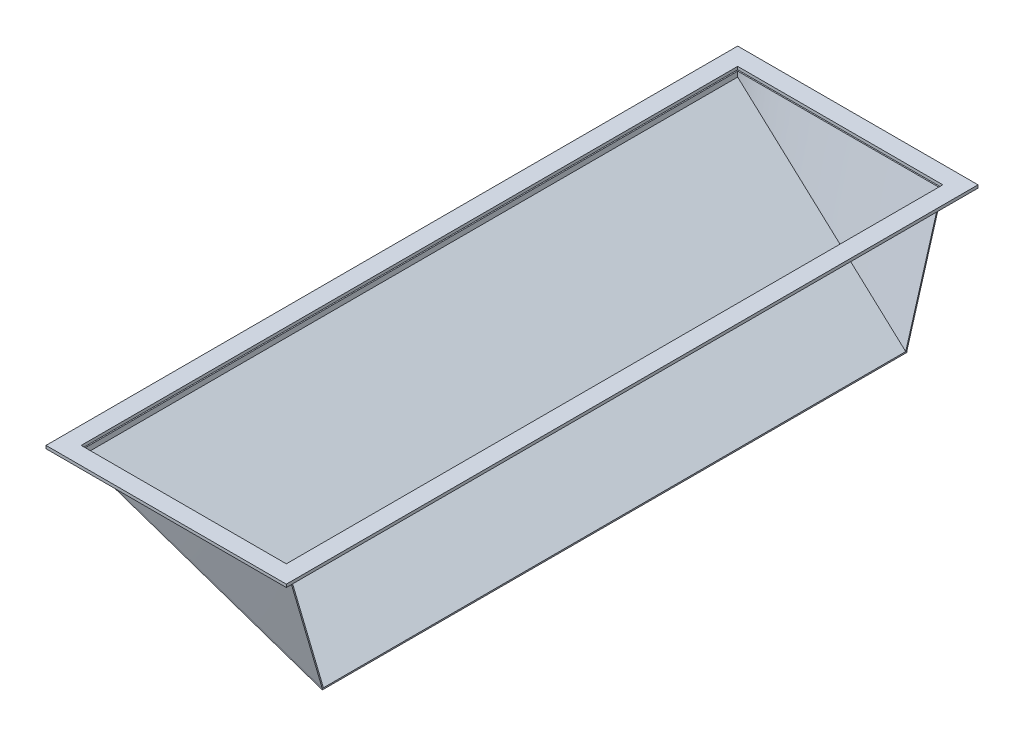
ISO-10303-21;
HEADER;
FILE_DESCRIPTION(('STEP AP214'),'2;1');
FILE_NAME('part.step','',(''),(''),'','','');
FILE_SCHEMA(('AUTOMOTIVE_DESIGN { 1 0 10303 214 1 1 1 1 }'));
ENDSEC;
DATA;
#1=APPLICATION_CONTEXT('core data for automotive mechanical design processes');
#2=APPLICATION_PROTOCOL_DEFINITION('international standard','automotive_design',2000,#1);
#3=PRODUCT_CONTEXT('',#1,'mechanical');
#4=PRODUCT('Part','Part','',(#3));
#5=PRODUCT_RELATED_PRODUCT_CATEGORY('part','',(#4));
#6=PRODUCT_DEFINITION_FORMATION('','',#4);
#7=PRODUCT_DEFINITION_CONTEXT('part definition',#1,'design');
#8=PRODUCT_DEFINITION('design','',#6,#7);
#9=PRODUCT_DEFINITION_SHAPE('','',#8);
#10=(LENGTH_UNIT() NAMED_UNIT(*) SI_UNIT(.MILLI.,.METRE.));
#11=(NAMED_UNIT(*) PLANE_ANGLE_UNIT() SI_UNIT($,.RADIAN.));
#12=(NAMED_UNIT(*) SI_UNIT($,.STERADIAN.) SOLID_ANGLE_UNIT());
#13=UNCERTAINTY_MEASURE_WITH_UNIT(LENGTH_MEASURE(1.E-05),#10,'distance_accuracy_value','');
#14=(GEOMETRIC_REPRESENTATION_CONTEXT(3) GLOBAL_UNCERTAINTY_ASSIGNED_CONTEXT((#13)) GLOBAL_UNIT_ASSIGNED_CONTEXT((#10,
#11,#12)) REPRESENTATION_CONTEXT('',''));
#15=CARTESIAN_POINT('',(0.,0.,0.));
#16=DIRECTION('',(0.,0.,1.));
#17=DIRECTION('',(1.,0.,0.));
#18=AXIS2_PLACEMENT_3D('',#15,#16,#17);
#19=CARTESIAN_POINT('',(0.,0.,1120.));
#20=DIRECTION('',(0.,1.,0.));
#21=DIRECTION('',(0.,0.,-1.));
#22=AXIS2_PLACEMENT_3D('',#19,#20,#21);
#23=PLANE('',#22);
#24=DIRECTION('',(0.,0.,1.));
#25=VECTOR('',#24,1.);
#26=CARTESIAN_POINT('',(2.00000000000004,0.,2.));
#27=LINE('',#26,#25);
#28=CARTESIAN_POINT('',(2.00000000000003,0.,0.));
#29=VERTEX_POINT('',#28);
#30=CARTESIAN_POINT('',(2.00000000000004,0.,2.));
#31=VERTEX_POINT('',#30);
#32=EDGE_CURVE('E103',#29,#31,#27,.T.);
#33=ORIENTED_EDGE('',*,*,#32,.T.);
#34=DIRECTION('',(1.,0.,0.));
#35=VECTOR('',#34,1.);
#36=CARTESIAN_POINT('',(350.,0.,2.));
#37=LINE('',#36,#35);
#38=CARTESIAN_POINT('',(350.,0.,2.));
#39=VERTEX_POINT('',#38);
#40=EDGE_CURVE('E109',#31,#39,#37,.T.);
#41=ORIENTED_EDGE('',*,*,#40,.T.);
#42=DIRECTION('',(0.,0.,-1.));
#43=VECTOR('',#42,1.);
#44=CARTESIAN_POINT('',(350.,0.,0.));
#45=LINE('',#44,#43);
#46=CARTESIAN_POINT('',(350.,0.,0.));
#47=VERTEX_POINT('',#46);
#48=EDGE_CURVE('E117',#39,#47,#45,.T.);
#49=ORIENTED_EDGE('',*,*,#48,.T.);
#50=DIRECTION('',(-1.,0.,0.));
#51=VECTOR('',#50,1.);
#52=CARTESIAN_POINT('',(2.00000000000003,0.,0.));
#53=LINE('',#52,#51);
#54=EDGE_CURVE('E122',#47,#29,#53,.T.);
#55=ORIENTED_EDGE('',*,*,#54,.T.);
#56=EDGE_LOOP('',(#33,#41,#49,#55));
#57=FACE_BOUND('',#56,.T.);
#58=ADVANCED_FACE('F54',(#57),#23,.T.);
#59=CARTESIAN_POINT('',(-3.33012701892212,-5.76794919243114,1120.));
#60=DIRECTION('',(-0.499999999999998,-0.86602540378444,0.));
#61=DIRECTION('',(0.86602540378444,-0.499999999999998,0.));
#62=AXIS2_PLACEMENT_3D('',#59,#60,#61);
#63=PLANE('',#62);
#64=DIRECTION('',(0.,0.,-1.));
#65=VECTOR('',#64,1.);
#66=CARTESIAN_POINT('',(1.99999999999995,-8.84529946162075,0.));
#67=LINE('',#66,#65);
#68=CARTESIAN_POINT('',(1.99999999999995,-8.84529946162075,2.));
#69=VERTEX_POINT('',#68);
#70=CARTESIAN_POINT('',(1.99999999999995,-8.84529946162075,0.));
#71=VERTEX_POINT('',#70);
#72=EDGE_CURVE('E106',#69,#71,#67,.T.);
#73=ORIENTED_EDGE('',*,*,#72,.T.);
#74=DIRECTION('',(0.856128098439509,-0.49428578809485,0.150752242934568));
#75=VECTOR('',#74,1.);
#76=CARTESIAN_POINT('',(1.99999999999995,-8.84529946162075,0.));
#77=LINE('',#76,#75);
#78=CARTESIAN_POINT('',(350.,-209.763193139609,61.2779566946273));
#79=VERTEX_POINT('',#78);
#80=EDGE_CURVE('E13',#71,#79,#77,.T.);
#81=ORIENTED_EDGE('',*,*,#80,.T.);
#82=DIRECTION('',(0.,0.,1.));
#83=VECTOR('',#82,1.);
#84=CARTESIAN_POINT('',(350.,-209.763193139609,61.2779566946273));
#85=LINE('',#84,#83);
#86=CARTESIAN_POINT('',(350.,-209.763193139609,63.3010951441988));
#87=VERTEX_POINT('',#86);
#88=EDGE_CURVE('E65',#79,#87,#85,.T.);
#89=ORIENTED_EDGE('',*,*,#88,.T.);
#90=DIRECTION('',(-0.85612075037956,0.49428154569046,-0.150807872338909));
#91=VECTOR('',#90,1.);
#92=CARTESIAN_POINT('',(1.99999999999995,-8.84529946162075,2.));
#93=LINE('',#92,#91);
#94=EDGE_CURVE('E197',#87,#69,#93,.T.);
#95=ORIENTED_EDGE('',*,*,#94,.T.);
#96=EDGE_LOOP('',(#73,#81,#89,#95));
#97=FACE_BOUND('',#96,.T.);
#98=ADVANCED_FACE('F262',(#97),#63,.T.);
#99=CARTESIAN_POINT('',(1.99999999999995,-8.84529946162075,0.));
#100=CARTESIAN_POINT('',(2.00000000000003,0.,0.));
#101=CARTESIAN_POINT('',(59.9999999999999,-42.3316150746188,10.2129927824379));
#102=CARTESIAN_POINT('',(60.,0.,0.));
#103=CARTESIAN_POINT('',(118.,-75.8179306876169,20.4259855648758));
#104=CARTESIAN_POINT('',(118.,0.,0.));
#105=CARTESIAN_POINT('',(234.,-142.790561913613,40.8519711297517));
#106=CARTESIAN_POINT('',(234.,0.,0.));
#107=CARTESIAN_POINT('',(292.,-176.276877526611,51.0649639121894));
#108=CARTESIAN_POINT('',(292.,0.,0.));
#109=CARTESIAN_POINT('',(350.,-209.763193139609,61.2779566946273));
#110=CARTESIAN_POINT('',(350.,0.,0.));
#111=B_SPLINE_SURFACE_WITH_KNOTS('',3,1,((#99,#100),(#101,#102),(#103,#104),(#105,#106),(#107,
#108),(#109,#110)),.UNSPECIFIED.,.F.,.F.,.F.,(4,2,4),(2,2),(0.,0.5,1.),(0.,1.),.UNSPECIFIED.);
#112=DIRECTION('',(0.,-1.,0.));
#113=VECTOR('',#112,1.);
#114=CARTESIAN_POINT('',(1.99999999999999,-4.42264973081038,0.));
#115=LINE('',#114,#113);
#116=EDGE_CURVE('E193',#29,#71,#115,.T.);
#117=DIRECTION('',(0.,0.95988056828562,-0.280409155748658));
#118=VECTOR('',#117,1.);
#119=CARTESIAN_POINT('',(350.,-104.881596569805,30.6389783473136));
#120=LINE('',#119,#118);
#121=EDGE_CURVE('E74',#79,#47,#120,.T.);
#122=ORIENTED_EDGE('',*,*,#80,.F.);
#123=ORIENTED_EDGE('',*,*,#116,.F.);
#124=ORIENTED_EDGE('',*,*,#54,.F.);
#125=ORIENTED_EDGE('',*,*,#121,.F.);
#126=EDGE_LOOP('',(#122,#123,#124,#125));
#127=FACE_BOUND('',#126,.T.);
#128=ADVANCED_FACE('F174',(#127),#111,.F.);
#129=CARTESIAN_POINT('',(350.,1.85246063812627E-13,1120.));
#130=DIRECTION('',(1.,0.,0.));
#131=DIRECTION('',(0.,1.,0.));
#132=AXIS2_PLACEMENT_3D('',#129,#130,#131);
#133=PLANE('',#132);
#134=DIRECTION('',(0.,0.959852065047477,-0.28050670798413));
#135=VECTOR('',#134,1.);
#136=CARTESIAN_POINT('',(350.,-209.763193139609,63.3010951441988));
#137=LINE('',#136,#135);
#138=EDGE_CURVE('E94',#87,#39,#137,.T.);
#139=ORIENTED_EDGE('',*,*,#138,.F.);
#140=ORIENTED_EDGE('',*,*,#88,.F.);
#141=ORIENTED_EDGE('',*,*,#121,.T.);
#142=ORIENTED_EDGE('',*,*,#48,.F.);
#143=EDGE_LOOP('',(#139,#140,#141,#142));
#144=FACE_BOUND('',#143,.T.);
#145=ADVANCED_FACE('F153',(#144),#133,.T.);
#146=CARTESIAN_POINT('',(2.00000000000429,0.,1120.));
#147=DIRECTION('',(-1.,0.,0.));
#148=DIRECTION('',(0.,-1.,0.));
#149=AXIS2_PLACEMENT_3D('',#146,#147,#148);
#150=PLANE('',#149);
#151=ORIENTED_EDGE('',*,*,#116,.T.);
#152=ORIENTED_EDGE('',*,*,#72,.F.);
#153=DIRECTION('',(0.,1.,0.));
#154=VECTOR('',#153,1.);
#155=CARTESIAN_POINT('',(2.,-4.42264973081038,2.));
#156=LINE('',#155,#154);
#157=EDGE_CURVE('E100',#69,#31,#156,.T.);
#158=ORIENTED_EDGE('',*,*,#157,.T.);
#159=ORIENTED_EDGE('',*,*,#32,.F.);
#160=EDGE_LOOP('',(#151,#152,#158,#159));
#161=FACE_BOUND('',#160,.T.);
#162=ADVANCED_FACE('F101',(#161),#150,.T.);
#163=CARTESIAN_POINT('',(350.,-209.763193139609,63.3010951441988));
#164=CARTESIAN_POINT('',(350.,0.,2.));
#165=CARTESIAN_POINT('',(292.,-176.276877526611,53.084245953499));
#166=CARTESIAN_POINT('',(292.,0.,2.));
#167=CARTESIAN_POINT('',(234.,-142.790561913613,42.8673967627993));
#168=CARTESIAN_POINT('',(234.,0.,2.));
#169=CARTESIAN_POINT('',(118.,-75.8179306876169,22.4336983813997));
#170=CARTESIAN_POINT('',(118.,0.,2.));
#171=CARTESIAN_POINT('',(59.9999999999999,-42.3316150746188,12.2168491906998));
#172=CARTESIAN_POINT('',(59.9999999999999,0.,2.));
#173=CARTESIAN_POINT('',(1.99999999999995,-8.84529946162075,2.));
#174=CARTESIAN_POINT('',(2.00000000000005,0.,2.));
#175=B_SPLINE_SURFACE_WITH_KNOTS('',3,1,((#163,#164),(#165,#166),(#167,#168),(#169,#170),(#171,
#172),(#173,#174)),.UNSPECIFIED.,.F.,.F.,.F.,(4,2,4),(2,2),(0.,0.5,1.),(0.,1.),.UNSPECIFIED.);
#176=ORIENTED_EDGE('',*,*,#94,.F.);
#177=ORIENTED_EDGE('',*,*,#138,.T.);
#178=ORIENTED_EDGE('',*,*,#40,.F.);
#179=ORIENTED_EDGE('',*,*,#157,.F.);
#180=EDGE_LOOP('',(#176,#177,#178,#179));
#181=FACE_BOUND('',#180,.T.);
#182=ADVANCED_FACE('F113',(#181),#175,.F.);
#183=CLOSED_SHELL('',(#58,#98,#128,#145,#162,#182));
#184=MANIFOLD_SOLID_BREP('B2',#183);
#185=CARTESIAN_POINT('',(0.,0.,0.));
#186=DIRECTION('',(0.,1.,0.));
#187=DIRECTION('',(0.,0.,1.));
#188=AXIS2_PLACEMENT_3D('',#185,#186,#187);
#189=PLANE('',#188);
#190=DIRECTION('',(0.,0.,-1.));
#191=VECTOR('',#190,1.);
#192=CARTESIAN_POINT('',(2.00000000000011,0.,1118.));
#193=LINE('',#192,#191);
#194=CARTESIAN_POINT('',(2.0000000000001,0.,1120.));
#195=VERTEX_POINT('',#194);
#196=CARTESIAN_POINT('',(2.00000000000011,0.,1118.));
#197=VERTEX_POINT('',#196);
#198=EDGE_CURVE('E431',#195,#197,#193,.T.);
#199=ORIENTED_EDGE('',*,*,#198,.F.);
#200=DIRECTION('',(-1.,0.,0.));
#201=VECTOR('',#200,1.);
#202=CARTESIAN_POINT('',(2.0000000000001,0.,1120.));
#203=LINE('',#202,#201);
#204=CARTESIAN_POINT('',(350.,0.,1120.));
#205=VERTEX_POINT('',#204);
#206=EDGE_CURVE('E450',#205,#195,#203,.T.);
#207=ORIENTED_EDGE('',*,*,#206,.F.);
#208=DIRECTION('',(0.,0.,1.));
#209=VECTOR('',#208,1.);
#210=CARTESIAN_POINT('',(350.,0.,1120.));
#211=LINE('',#210,#209);
#212=CARTESIAN_POINT('',(350.,0.,1118.));
#213=VERTEX_POINT('',#212);
#214=EDGE_CURVE('E432',#213,#205,#211,.T.);
#215=ORIENTED_EDGE('',*,*,#214,.F.);
#216=DIRECTION('',(1.,0.,0.));
#217=VECTOR('',#216,1.);
#218=CARTESIAN_POINT('',(350.,0.,1118.));
#219=LINE('',#218,#217);
#220=EDGE_CURVE('E427',#197,#213,#219,.T.);
#221=ORIENTED_EDGE('',*,*,#220,.F.);
#222=EDGE_LOOP('',(#199,#207,#215,#221));
#223=FACE_BOUND('',#222,.T.);
#224=ADVANCED_FACE('F385',(#223),#189,.T.);
#225=CARTESIAN_POINT('',(-3.33012701892218,-5.76794919243114,0.));
#226=DIRECTION('',(-0.499999999999998,-0.86602540378444,0.));
#227=DIRECTION('',(0.86602540378444,-0.499999999999998,0.));
#228=AXIS2_PLACEMENT_3D('',#225,#226,#227);
#229=PLANE('',#228);
#230=DIRECTION('',(0.,0.,1.));
#231=VECTOR('',#230,1.);
#232=CARTESIAN_POINT('',(2.00000000000001,-8.84529946162075,1120.));
#233=LINE('',#232,#231);
#234=CARTESIAN_POINT('',(2.00000000000001,-8.84529946162075,1118.));
#235=VERTEX_POINT('',#234);
#236=CARTESIAN_POINT('',(2.00000000000001,-8.84529946162075,1120.));
#237=VERTEX_POINT('',#236);
#238=EDGE_CURVE('E467',#235,#237,#233,.T.);
#239=ORIENTED_EDGE('',*,*,#238,.F.);
#240=DIRECTION('',(-0.85612075037956,0.49428154569046,0.150807872338909));
#241=VECTOR('',#240,1.);
#242=CARTESIAN_POINT('',(2.00000000000001,-8.84529946162075,1118.));
#243=LINE('',#242,#241);
#244=CARTESIAN_POINT('',(350.,-209.763193139609,1056.6989048558));
#245=VERTEX_POINT('',#244);
#246=EDGE_CURVE('E456',#245,#235,#243,.T.);
#247=ORIENTED_EDGE('',*,*,#246,.F.);
#248=DIRECTION('',(0.,0.,-1.));
#249=VECTOR('',#248,1.);
#250=CARTESIAN_POINT('',(350.,-209.763193139609,1058.72204330537));
#251=LINE('',#250,#249);
#252=CARTESIAN_POINT('',(350.,-209.763193139609,1058.72204330537));
#253=VERTEX_POINT('',#252);
#254=EDGE_CURVE('E396',#253,#245,#251,.T.);
#255=ORIENTED_EDGE('',*,*,#254,.F.);
#256=DIRECTION('',(0.856128098439509,-0.49428578809485,-0.150752242934569));
#257=VECTOR('',#256,1.);
#258=CARTESIAN_POINT('',(2.00000000000001,-8.84529946162075,1120.));
#259=LINE('',#258,#257);
#260=EDGE_CURVE('E52',#237,#253,#259,.T.);
#261=ORIENTED_EDGE('',*,*,#260,.F.);
#262=EDGE_LOOP('',(#239,#247,#255,#261));
#263=FACE_BOUND('',#262,.T.);
#264=ADVANCED_FACE('F511',(#263),#229,.T.);
#265=CARTESIAN_POINT('',(2.00000000000001,-8.84529946162075,1120.));
#266=CARTESIAN_POINT('',(2.0000000000001,0.,1120.));
#267=CARTESIAN_POINT('',(60.,-42.3316150746188,1109.78700721756));
#268=CARTESIAN_POINT('',(60.,0.,1120.));
#269=CARTESIAN_POINT('',(118.,-75.8179306876169,1099.57401443512));
#270=CARTESIAN_POINT('',(118.,0.,1120.));
#271=CARTESIAN_POINT('',(234.,-142.790561913613,1079.14802887025));
#272=CARTESIAN_POINT('',(234.,0.,1120.));
#273=CARTESIAN_POINT('',(292.,-176.276877526611,1068.93503608781));
#274=CARTESIAN_POINT('',(292.,0.,1120.));
#275=CARTESIAN_POINT('',(350.,-209.763193139609,1058.72204330537));
#276=CARTESIAN_POINT('',(350.,0.,1120.));
#277=B_SPLINE_SURFACE_WITH_KNOTS('',3,1,((#265,#266),(#267,#268),(#269,#270),(#271,#272),(#273,
#274),(#275,#276)),.UNSPECIFIED.,.F.,.F.,.F.,(4,2,4),(2,2),(0.,0.5,1.),(0.,1.),.UNSPECIFIED.);
#278=DIRECTION('',(0.,0.95988056828562,0.280409155748658));
#279=VECTOR('',#278,1.);
#280=CARTESIAN_POINT('',(350.,-104.881596569805,1089.36102165269));
#281=LINE('',#280,#279);
#282=EDGE_CURVE('E405',#253,#205,#281,.T.);
#283=DIRECTION('',(0.,-1.,0.));
#284=VECTOR('',#283,1.);
#285=CARTESIAN_POINT('',(2.00000000000006,-4.42264973081038,1120.));
#286=LINE('',#285,#284);
#287=EDGE_CURVE('E449',#195,#237,#286,.T.);
#288=ORIENTED_EDGE('',*,*,#260,.T.);
#289=ORIENTED_EDGE('',*,*,#282,.T.);
#290=ORIENTED_EDGE('',*,*,#206,.T.);
#291=ORIENTED_EDGE('',*,*,#287,.T.);
#292=EDGE_LOOP('',(#288,#289,#290,#291));
#293=FACE_BOUND('',#292,.T.);
#294=ADVANCED_FACE('F500',(#293),#277,.T.);
#295=CARTESIAN_POINT('',(350.,1.85246063812627E-13,0.));
#296=DIRECTION('',(1.,0.,0.));
#297=DIRECTION('',(0.,1.,0.));
#298=AXIS2_PLACEMENT_3D('',#295,#296,#297);
#299=PLANE('',#298);
#300=DIRECTION('',(0.,0.959852065047477,0.28050670798413));
#301=VECTOR('',#300,1.);
#302=CARTESIAN_POINT('',(350.,-209.763193139609,1056.6989048558));
#303=LINE('',#302,#301);
#304=EDGE_CURVE('E421',#245,#213,#303,.T.);
#305=ORIENTED_EDGE('',*,*,#304,.T.);
#306=ORIENTED_EDGE('',*,*,#214,.T.);
#307=ORIENTED_EDGE('',*,*,#282,.F.);
#308=ORIENTED_EDGE('',*,*,#254,.T.);
#309=EDGE_LOOP('',(#305,#306,#307,#308));
#310=FACE_BOUND('',#309,.T.);
#311=ADVANCED_FACE('F479',(#310),#299,.T.);
#312=CARTESIAN_POINT('',(2.00000000000423,0.,0.));
#313=DIRECTION('',(-1.,0.,0.));
#314=DIRECTION('',(0.,-1.,0.));
#315=AXIS2_PLACEMENT_3D('',#312,#313,#314);
#316=PLANE('',#315);
#317=ORIENTED_EDGE('',*,*,#287,.F.);
#318=ORIENTED_EDGE('',*,*,#198,.T.);
#319=DIRECTION('',(0.,1.,0.));
#320=VECTOR('',#319,1.);
#321=CARTESIAN_POINT('',(2.00000000000006,-4.42264973081038,1118.));
#322=LINE('',#321,#320);
#323=EDGE_CURVE('E437',#235,#197,#322,.T.);
#324=ORIENTED_EDGE('',*,*,#323,.F.);
#325=ORIENTED_EDGE('',*,*,#238,.T.);
#326=EDGE_LOOP('',(#317,#318,#324,#325));
#327=FACE_BOUND('',#326,.T.);
#328=ADVANCED_FACE('F445',(#327),#316,.T.);
#329=CARTESIAN_POINT('',(350.,-209.763193139609,1056.6989048558));
#330=CARTESIAN_POINT('',(350.,0.,1118.));
#331=CARTESIAN_POINT('',(292.,-176.276877526611,1066.9157540465));
#332=CARTESIAN_POINT('',(292.,0.,1118.));
#333=CARTESIAN_POINT('',(234.,-142.790561913613,1077.1326032372));
#334=CARTESIAN_POINT('',(234.,0.,1118.));
#335=CARTESIAN_POINT('',(118.,-75.8179306876169,1097.5663016186));
#336=CARTESIAN_POINT('',(118.,0.,1118.));
#337=CARTESIAN_POINT('',(60.,-42.3316150746188,1107.7831508093));
#338=CARTESIAN_POINT('',(60.,0.,1118.));
#339=CARTESIAN_POINT('',(2.00000000000001,-8.84529946162075,1118.));
#340=CARTESIAN_POINT('',(2.00000000000011,0.,1118.));
#341=B_SPLINE_SURFACE_WITH_KNOTS('',3,1,((#329,#330),(#331,#332),(#333,#334),(#335,#336),(#337,
#338),(#339,#340)),.UNSPECIFIED.,.F.,.F.,.F.,(4,2,4),(2,2),(0.,0.5,1.),(0.,1.),.UNSPECIFIED.);
#342=ORIENTED_EDGE('',*,*,#246,.T.);
#343=ORIENTED_EDGE('',*,*,#323,.T.);
#344=ORIENTED_EDGE('',*,*,#220,.T.);
#345=ORIENTED_EDGE('',*,*,#304,.F.);
#346=EDGE_LOOP('',(#342,#343,#344,#345));
#347=FACE_BOUND('',#346,.T.);
#348=ADVANCED_FACE('F454',(#347),#341,.T.);
#349=CLOSED_SHELL('',(#224,#264,#294,#311,#328,#348));
#350=MANIFOLD_SOLID_BREP('B7',#349);
#351=CARTESIAN_POINT('',(0.,5.,0.));
#352=DIRECTION('',(0.,-1.,0.));
#353=DIRECTION('',(0.,0.,-1.));
#354=AXIS2_PLACEMENT_3D('',#351,#352,#353);
#355=PLANE('',#354);
#356=DIRECTION('',(0.,0.,1.));
#357=VECTOR('',#356,1.);
#358=CARTESIAN_POINT('',(-29.9999999999997,5.,1150.));
#359=LINE('',#358,#357);
#360=CARTESIAN_POINT('',(-29.9999999999998,5.,-30.));
#361=VERTEX_POINT('',#360);
#362=CARTESIAN_POINT('',(-29.9999999999997,5.,1150.));
#363=VERTEX_POINT('',#362);
#364=EDGE_CURVE('E816',#361,#363,#359,.T.);
#365=ORIENTED_EDGE('',*,*,#364,.T.);
#366=DIRECTION('',(1.,0.,0.));
#367=VECTOR('',#366,1.);
#368=CARTESIAN_POINT('',(380.,5.,1150.));
#369=LINE('',#368,#367);
#370=CARTESIAN_POINT('',(380.,5.,1150.));
#371=VERTEX_POINT('',#370);
#372=EDGE_CURVE('E819',#363,#371,#369,.T.);
#373=ORIENTED_EDGE('',*,*,#372,.T.);
#374=DIRECTION('',(0.,0.,-1.));
#375=VECTOR('',#374,1.);
#376=CARTESIAN_POINT('',(380.,5.,-30.));
#377=LINE('',#376,#375);
#378=CARTESIAN_POINT('',(380.,5.,-30.));
#379=VERTEX_POINT('',#378);
#380=EDGE_CURVE('E822',#371,#379,#377,.T.);
#381=ORIENTED_EDGE('',*,*,#380,.T.);
#382=DIRECTION('',(-1.,0.,0.));
#383=VECTOR('',#382,1.);
#384=CARTESIAN_POINT('',(-29.9999999999998,5.,-30.));
#385=LINE('',#384,#383);
#386=EDGE_CURVE('E824',#379,#361,#385,.T.);
#387=ORIENTED_EDGE('',*,*,#386,.T.);
#388=EDGE_LOOP('',(#365,#373,#381,#387));
#389=FACE_BOUND('',#388,.T.);
#390=DIRECTION('',(-1.,0.,0.));
#391=VECTOR('',#390,1.);
#392=CARTESIAN_POINT('',(350.,5.,0.));
#393=LINE('',#392,#391);
#394=CARTESIAN_POINT('',(350.,5.,0.));
#395=VERTEX_POINT('',#394);
#396=CARTESIAN_POINT('',(1.11022302462516E-13,5.,0.));
#397=VERTEX_POINT('',#396);
#398=EDGE_CURVE('E780',#395,#397,#393,.T.);
#399=ORIENTED_EDGE('',*,*,#398,.F.);
#400=DIRECTION('',(0.,0.,-1.));
#401=VECTOR('',#400,1.);
#402=CARTESIAN_POINT('',(350.,5.,1120.));
#403=LINE('',#402,#401);
#404=CARTESIAN_POINT('',(350.,5.,1120.));
#405=VERTEX_POINT('',#404);
#406=EDGE_CURVE('E802',#405,#395,#403,.T.);
#407=ORIENTED_EDGE('',*,*,#406,.F.);
#408=DIRECTION('',(1.,0.,0.));
#409=VECTOR('',#408,1.);
#410=CARTESIAN_POINT('',(2.4826879285408E-13,5.,1120.));
#411=LINE('',#410,#409);
#412=CARTESIAN_POINT('',(2.4826879285408E-13,5.,1120.));
#413=VERTEX_POINT('',#412);
#414=EDGE_CURVE('E800',#413,#405,#411,.T.);
#415=ORIENTED_EDGE('',*,*,#414,.F.);
#416=DIRECTION('',(0.,0.,1.));
#417=VECTOR('',#416,1.);
#418=CARTESIAN_POINT('',(1.11022302462516E-13,5.,0.));
#419=LINE('',#418,#417);
#420=EDGE_CURVE('E788',#397,#413,#419,.T.);
#421=ORIENTED_EDGE('',*,*,#420,.F.);
#422=EDGE_LOOP('',(#399,#407,#415,#421));
#423=FACE_BOUND('',#422,.T.);
#424=ADVANCED_FACE('F715',(#389,#423),#355,.F.);
#425=CARTESIAN_POINT('',(0.,0.,0.));
#426=DIRECTION('',(0.,-1.,0.));
#427=DIRECTION('',(0.,0.,-1.));
#428=AXIS2_PLACEMENT_3D('',#425,#426,#427);
#429=PLANE('',#428);
#430=DIRECTION('',(0.,0.,1.));
#431=VECTOR('',#430,1.);
#432=CARTESIAN_POINT('',(-29.9999999999997,0.,1150.));
#433=LINE('',#432,#431);
#434=CARTESIAN_POINT('',(-29.9999999999998,0.,-30.));
#435=VERTEX_POINT('',#434);
#436=CARTESIAN_POINT('',(-29.9999999999997,0.,1150.));
#437=VERTEX_POINT('',#436);
#438=EDGE_CURVE('E796',#435,#437,#433,.T.);
#439=ORIENTED_EDGE('',*,*,#438,.F.);
#440=DIRECTION('',(-1.,0.,0.));
#441=VECTOR('',#440,1.);
#442=CARTESIAN_POINT('',(-29.9999999999998,0.,-30.));
#443=LINE('',#442,#441);
#444=CARTESIAN_POINT('',(380.,0.,-30.));
#445=VERTEX_POINT('',#444);
#446=EDGE_CURVE('E820',#445,#435,#443,.T.);
#447=ORIENTED_EDGE('',*,*,#446,.F.);
#448=DIRECTION('',(0.,0.,-1.));
#449=VECTOR('',#448,1.);
#450=CARTESIAN_POINT('',(380.,0.,-30.));
#451=LINE('',#450,#449);
#452=CARTESIAN_POINT('',(380.,0.,1150.));
#453=VERTEX_POINT('',#452);
#454=EDGE_CURVE('E831',#453,#445,#451,.T.);
#455=ORIENTED_EDGE('',*,*,#454,.F.);
#456=DIRECTION('',(1.,0.,0.));
#457=VECTOR('',#456,1.);
#458=CARTESIAN_POINT('',(380.,0.,1150.));
#459=LINE('',#458,#457);
#460=EDGE_CURVE('E829',#437,#453,#459,.T.);
#461=ORIENTED_EDGE('',*,*,#460,.F.);
#462=EDGE_LOOP('',(#439,#447,#455,#461));
#463=FACE_BOUND('',#462,.T.);
#464=DIRECTION('',(0.,0.,-1.));
#465=VECTOR('',#464,1.);
#466=CARTESIAN_POINT('',(350.,0.,1120.));
#467=LINE('',#466,#465);
#468=CARTESIAN_POINT('',(350.,0.,1120.));
#469=VERTEX_POINT('',#468);
#470=CARTESIAN_POINT('',(350.,0.,0.));
#471=VERTEX_POINT('',#470);
#472=EDGE_CURVE('E789',#469,#471,#467,.T.);
#473=ORIENTED_EDGE('',*,*,#472,.T.);
#474=DIRECTION('',(-1.,0.,0.));
#475=VECTOR('',#474,1.);
#476=CARTESIAN_POINT('',(350.,0.,0.));
#477=LINE('',#476,#475);
#478=CARTESIAN_POINT('',(1.11022302462516E-13,0.,0.));
#479=VERTEX_POINT('',#478);
#480=EDGE_CURVE('E738',#471,#479,#477,.T.);
#481=ORIENTED_EDGE('',*,*,#480,.T.);
#482=DIRECTION('',(0.,0.,1.));
#483=VECTOR('',#482,1.);
#484=CARTESIAN_POINT('',(1.11022302462516E-13,0.,0.));
#485=LINE('',#484,#483);
#486=CARTESIAN_POINT('',(2.4826879285408E-13,0.,1120.));
#487=VERTEX_POINT('',#486);
#488=EDGE_CURVE('E795',#479,#487,#485,.T.);
#489=ORIENTED_EDGE('',*,*,#488,.T.);
#490=DIRECTION('',(1.,0.,0.));
#491=VECTOR('',#490,1.);
#492=CARTESIAN_POINT('',(2.4826879285408E-13,0.,1120.));
#493=LINE('',#492,#491);
#494=EDGE_CURVE('E808',#487,#469,#493,.T.);
#495=ORIENTED_EDGE('',*,*,#494,.T.);
#496=EDGE_LOOP('',(#473,#481,#489,#495));
#497=FACE_BOUND('',#496,.T.);
#498=ADVANCED_FACE('F849',(#463,#497),#429,.T.);
#499=CARTESIAN_POINT('',(-29.9999999999997,5.,1150.));
#500=DIRECTION('',(1.,0.,0.));
#501=DIRECTION('',(0.,0.,-1.));
#502=AXIS2_PLACEMENT_3D('',#499,#500,#501);
#503=PLANE('',#502);
#504=ORIENTED_EDGE('',*,*,#438,.T.);
#505=DIRECTION('',(0.,-1.,0.));
#506=VECTOR('',#505,1.);
#507=CARTESIAN_POINT('',(-29.9999999999997,5.,1150.));
#508=LINE('',#507,#506);
#509=EDGE_CURVE('E383',#363,#437,#508,.T.);
#510=ORIENTED_EDGE('',*,*,#509,.F.);
#511=ORIENTED_EDGE('',*,*,#364,.F.);
#512=DIRECTION('',(0.,-1.,0.));
#513=VECTOR('',#512,1.);
#514=CARTESIAN_POINT('',(-29.9999999999998,5.,-30.));
#515=LINE('',#514,#513);
#516=EDGE_CURVE('E826',#361,#435,#515,.T.);
#517=ORIENTED_EDGE('',*,*,#516,.T.);
#518=EDGE_LOOP('',(#504,#510,#511,#517));
#519=FACE_BOUND('',#518,.T.);
#520=ADVANCED_FACE('F717',(#519),#503,.F.);
#521=CARTESIAN_POINT('',(380.,5.,1150.));
#522=DIRECTION('',(0.,0.,-1.));
#523=DIRECTION('',(-1.,0.,0.));
#524=AXIS2_PLACEMENT_3D('',#521,#522,#523);
#525=PLANE('',#524);
#526=ORIENTED_EDGE('',*,*,#460,.T.);
#527=DIRECTION('',(0.,-1.,0.));
#528=VECTOR('',#527,1.);
#529=CARTESIAN_POINT('',(380.,5.,1150.));
#530=LINE('',#529,#528);
#531=EDGE_CURVE('E723',#371,#453,#530,.T.);
#532=ORIENTED_EDGE('',*,*,#531,.F.);
#533=ORIENTED_EDGE('',*,*,#372,.F.);
#534=ORIENTED_EDGE('',*,*,#509,.T.);
#535=EDGE_LOOP('',(#526,#532,#533,#534));
#536=FACE_BOUND('',#535,.T.);
#537=ADVANCED_FACE('F859',(#536),#525,.F.);
#538=CARTESIAN_POINT('',(380.,5.,-30.));
#539=DIRECTION('',(-1.,0.,0.));
#540=DIRECTION('',(0.,0.,1.));
#541=AXIS2_PLACEMENT_3D('',#538,#539,#540);
#542=PLANE('',#541);
#543=ORIENTED_EDGE('',*,*,#454,.T.);
#544=DIRECTION('',(0.,-1.,0.));
#545=VECTOR('',#544,1.);
#546=CARTESIAN_POINT('',(380.,5.,-30.));
#547=LINE('',#546,#545);
#548=EDGE_CURVE('E836',#379,#445,#547,.T.);
#549=ORIENTED_EDGE('',*,*,#548,.F.);
#550=ORIENTED_EDGE('',*,*,#380,.F.);
#551=ORIENTED_EDGE('',*,*,#531,.T.);
#552=EDGE_LOOP('',(#543,#549,#550,#551));
#553=FACE_BOUND('',#552,.T.);
#554=ADVANCED_FACE('F843',(#553),#542,.F.);
#555=CARTESIAN_POINT('',(-29.9999999999998,5.,-30.));
#556=DIRECTION('',(0.,0.,1.));
#557=DIRECTION('',(1.,0.,0.));
#558=AXIS2_PLACEMENT_3D('',#555,#556,#557);
#559=PLANE('',#558);
#560=ORIENTED_EDGE('',*,*,#446,.T.);
#561=ORIENTED_EDGE('',*,*,#516,.F.);
#562=ORIENTED_EDGE('',*,*,#386,.F.);
#563=ORIENTED_EDGE('',*,*,#548,.T.);
#564=EDGE_LOOP('',(#560,#561,#562,#563));
#565=FACE_BOUND('',#564,.T.);
#566=ADVANCED_FACE('F853',(#565),#559,.F.);
#567=CARTESIAN_POINT('',(350.,5.,0.));
#568=DIRECTION('',(0.,0.,1.));
#569=DIRECTION('',(1.,0.,0.));
#570=AXIS2_PLACEMENT_3D('',#567,#568,#569);
#571=PLANE('',#570);
#572=ORIENTED_EDGE('',*,*,#480,.F.);
#573=DIRECTION('',(0.,-1.,0.));
#574=VECTOR('',#573,1.);
#575=CARTESIAN_POINT('',(350.,5.,0.));
#576=LINE('',#575,#574);
#577=EDGE_CURVE('E784',#395,#471,#576,.T.);
#578=ORIENTED_EDGE('',*,*,#577,.F.);
#579=ORIENTED_EDGE('',*,*,#398,.T.);
#580=DIRECTION('',(0.,-1.,0.));
#581=VECTOR('',#580,1.);
#582=CARTESIAN_POINT('',(1.11022302462516E-13,5.,0.));
#583=LINE('',#582,#581);
#584=EDGE_CURVE('E783',#397,#479,#583,.T.);
#585=ORIENTED_EDGE('',*,*,#584,.T.);
#586=EDGE_LOOP('',(#572,#578,#579,#585));
#587=FACE_BOUND('',#586,.T.);
#588=ADVANCED_FACE('F782',(#587),#571,.T.);
#589=CARTESIAN_POINT('',(1.11022302462516E-13,5.,0.));
#590=DIRECTION('',(1.,0.,0.));
#591=DIRECTION('',(0.,0.,-1.));
#592=AXIS2_PLACEMENT_3D('',#589,#590,#591);
#593=PLANE('',#592);
#594=ORIENTED_EDGE('',*,*,#488,.F.);
#595=ORIENTED_EDGE('',*,*,#584,.F.);
#596=ORIENTED_EDGE('',*,*,#420,.T.);
#597=DIRECTION('',(0.,-1.,0.));
#598=VECTOR('',#597,1.);
#599=CARTESIAN_POINT('',(2.4826879285408E-13,5.,1120.));
#600=LINE('',#599,#598);
#601=EDGE_CURVE('E797',#413,#487,#600,.T.);
#602=ORIENTED_EDGE('',*,*,#601,.T.);
#603=EDGE_LOOP('',(#594,#595,#596,#602));
#604=FACE_BOUND('',#603,.T.);
#605=ADVANCED_FACE('F792',(#604),#593,.T.);
#606=CARTESIAN_POINT('',(2.4826879285408E-13,5.,1120.));
#607=DIRECTION('',(0.,0.,-1.));
#608=DIRECTION('',(-1.,0.,0.));
#609=AXIS2_PLACEMENT_3D('',#606,#607,#608);
#610=PLANE('',#609);
#611=ORIENTED_EDGE('',*,*,#494,.F.);
#612=ORIENTED_EDGE('',*,*,#601,.F.);
#613=ORIENTED_EDGE('',*,*,#414,.T.);
#614=DIRECTION('',(0.,-1.,0.));
#615=VECTOR('',#614,1.);
#616=CARTESIAN_POINT('',(350.,5.,1120.));
#617=LINE('',#616,#615);
#618=EDGE_CURVE('E730',#405,#469,#617,.T.);
#619=ORIENTED_EDGE('',*,*,#618,.T.);
#620=EDGE_LOOP('',(#611,#612,#613,#619));
#621=FACE_BOUND('',#620,.T.);
#622=ADVANCED_FACE('F882',(#621),#610,.T.);
#623=CARTESIAN_POINT('',(350.,5.,1120.));
#624=DIRECTION('',(-1.,0.,0.));
#625=DIRECTION('',(0.,0.,1.));
#626=AXIS2_PLACEMENT_3D('',#623,#624,#625);
#627=PLANE('',#626);
#628=ORIENTED_EDGE('',*,*,#472,.F.);
#629=ORIENTED_EDGE('',*,*,#618,.F.);
#630=ORIENTED_EDGE('',*,*,#406,.T.);
#631=ORIENTED_EDGE('',*,*,#577,.T.);
#632=EDGE_LOOP('',(#628,#629,#630,#631));
#633=FACE_BOUND('',#632,.T.);
#634=ADVANCED_FACE('F886',(#633),#627,.T.);
#635=CLOSED_SHELL('',(#424,#498,#520,#537,#554,#566,#588,#605,#622,#634));
#636=MANIFOLD_SOLID_BREP('B46_NOT_SHOWN',#635);
#637=CARTESIAN_POINT('',(350.,0.,1120.));
#638=DIRECTION('',(-1.,0.,0.));
#639=DIRECTION('',(0.,-1.,0.));
#640=AXIS2_PLACEMENT_3D('',#637,#638,#639);
#641=PLANE('',#640);
#642=DIRECTION('',(0.,0.,-1.));
#643=VECTOR('',#642,1.);
#644=CARTESIAN_POINT('',(350.,-209.763193139609,1120.));
#645=LINE('',#644,#643);
#646=CARTESIAN_POINT('',(350.,-209.763193139609,1058.72204330537));
#647=VERTEX_POINT('',#646);
#648=CARTESIAN_POINT('',(350.,-209.763193139609,61.2779566946275));
#649=VERTEX_POINT('',#648);
#650=EDGE_CURVE('E1009',#647,#649,#645,.T.);
#651=ORIENTED_EDGE('',*,*,#650,.F.);
#652=DIRECTION('',(0.,-0.997105772080476,-0.0760268326566222));
#653=VECTOR('',#652,1.);
#654=CARTESIAN_POINT('',(350.,3.43283753280037,1074.97770985634));
#655=LINE('',#654,#653);
#656=CARTESIAN_POINT('',(350.,-212.072594216368,1058.54595722292));
#657=VERTEX_POINT('',#656);
#658=EDGE_CURVE('E958',#647,#657,#655,.T.);
#659=ORIENTED_EDGE('',*,*,#658,.T.);
#660=DIRECTION('',(0.,0.,-1.));
#661=VECTOR('',#660,1.);
#662=CARTESIAN_POINT('',(350.,-212.072594216368,1120.));
#663=LINE('',#662,#661);
#664=CARTESIAN_POINT('',(350.,-212.072594216368,61.4540427770831));
#665=VERTEX_POINT('',#664);
#666=EDGE_CURVE('E999',#657,#665,#663,.T.);
#667=ORIENTED_EDGE('',*,*,#666,.T.);
#668=DIRECTION('',(0.,0.997105772080476,-0.0760268326566224));
#669=VECTOR('',#668,1.);
#670=CARTESIAN_POINT('',(350.,-81.470771383104,51.4959789415115));
#671=LINE('',#670,#669);
#672=EDGE_CURVE('E1036',#665,#649,#671,.T.);
#673=ORIENTED_EDGE('',*,*,#672,.T.);
#674=EDGE_LOOP('',(#651,#659,#667,#673));
#675=FACE_BOUND('',#674,.T.);
#676=ADVANCED_FACE('F944',(#675),#641,.F.);
#677=CARTESIAN_POINT('',(0.,0.,1120.));
#678=DIRECTION('',(1.,0.,0.));
#679=DIRECTION('',(0.,1.,0.));
#680=AXIS2_PLACEMENT_3D('',#677,#678,#679);
#681=PLANE('',#680);
#682=DIRECTION('',(0.,-1.,0.));
#683=VECTOR('',#682,1.);
#684=CARTESIAN_POINT('',(0.,0.,0.));
#685=LINE('',#684,#683);
#686=CARTESIAN_POINT('',(0.,0.,0.));
#687=VERTEX_POINT('',#686);
#688=CARTESIAN_POINT('',(0.,-9.99999999999999,0.));
#689=VERTEX_POINT('',#688);
#690=EDGE_CURVE('E998',#687,#689,#685,.T.);
#691=ORIENTED_EDGE('',*,*,#690,.T.);
#692=DIRECTION('',(0.,0.,-1.));
#693=VECTOR('',#692,1.);
#694=CARTESIAN_POINT('',(0.,-9.99999999999999,1120.));
#695=LINE('',#694,#693);
#696=CARTESIAN_POINT('',(0.,-9.99999999999999,1120.));
#697=VERTEX_POINT('',#696);
#698=EDGE_CURVE('E952',#697,#689,#695,.T.);
#699=ORIENTED_EDGE('',*,*,#698,.F.);
#700=DIRECTION('',(0.,-1.,0.));
#701=VECTOR('',#700,1.);
#702=CARTESIAN_POINT('',(0.,0.,1120.));
#703=LINE('',#702,#701);
#704=CARTESIAN_POINT('',(0.,0.,1120.));
#705=VERTEX_POINT('',#704);
#706=EDGE_CURVE('E992',#705,#697,#703,.T.);
#707=ORIENTED_EDGE('',*,*,#706,.F.);
#708=DIRECTION('',(0.,0.,-1.));
#709=VECTOR('',#708,1.);
#710=CARTESIAN_POINT('',(0.,0.,1120.));
#711=LINE('',#710,#709);
#712=EDGE_CURVE('E984',#705,#687,#711,.T.);
#713=ORIENTED_EDGE('',*,*,#712,.T.);
#714=EDGE_LOOP('',(#691,#699,#707,#713));
#715=FACE_BOUND('',#714,.T.);
#716=ADVANCED_FACE('F946',(#715),#681,.F.);
#717=CARTESIAN_POINT('',(0.,-9.99999999999999,1120.));
#718=DIRECTION('',(0.499999999999998,0.86602540378444,0.));
#719=DIRECTION('',(-0.86602540378444,0.499999999999998,0.));
#720=AXIS2_PLACEMENT_3D('',#717,#718,#719);
#721=PLANE('',#720);
#722=ORIENTED_EDGE('',*,*,#666,.F.);
#723=DIRECTION('',(-0.856128098439509,0.49428578809485,0.150752242934569));
#724=VECTOR('',#723,1.);
#725=CARTESIAN_POINT('',(0.0227262387498047,-10.0131210000599,1120.17208430811));
#726=LINE('',#725,#724);
#727=CARTESIAN_POINT('',(1.,-10.5773502691896,1120.));
#728=VERTEX_POINT('',#727);
#729=EDGE_CURVE('E1024',#657,#728,#726,.T.);
#730=ORIENTED_EDGE('',*,*,#729,.T.);
#731=DIRECTION('',(0.86602540378444,-0.499999999999998,0.));
#732=VECTOR('',#731,1.);
#733=CARTESIAN_POINT('',(0.,-9.99999999999999,1120.));
#734=LINE('',#733,#732);
#735=EDGE_CURVE('E1022',#697,#728,#734,.T.);
#736=ORIENTED_EDGE('',*,*,#735,.F.);
#737=ORIENTED_EDGE('',*,*,#698,.T.);
#738=DIRECTION('',(0.86602540378444,-0.499999999999998,0.));
#739=VECTOR('',#738,1.);
#740=CARTESIAN_POINT('',(0.,-9.99999999999999,0.));
#741=LINE('',#740,#739);
#742=CARTESIAN_POINT('',(1.,-10.5773502691896,0.));
#743=VERTEX_POINT('',#742);
#744=EDGE_CURVE('E993',#689,#743,#741,.T.);
#745=ORIENTED_EDGE('',*,*,#744,.T.);
#746=DIRECTION('',(0.856128098439509,-0.49428578809485,0.150752242934569));
#747=VECTOR('',#746,1.);
#748=CARTESIAN_POINT('',(144.573545047301,-93.4695751507572,25.2813030916741));
#749=LINE('',#748,#747);
#750=EDGE_CURVE('E1040',#743,#665,#749,.T.);
#751=ORIENTED_EDGE('',*,*,#750,.T.);
#752=EDGE_LOOP('',(#722,#730,#736,#737,#745,#751));
#753=FACE_BOUND('',#752,.T.);
#754=ADVANCED_FACE('F1017',(#753),#721,.F.);
#755=CARTESIAN_POINT('',(0.,0.,1120.));
#756=DIRECTION('',(0.,-1.,0.));
#757=DIRECTION('',(0.,0.,-1.));
#758=AXIS2_PLACEMENT_3D('',#755,#756,#757);
#759=PLANE('',#758);
#760=DIRECTION('',(-1.,0.,0.));
#761=VECTOR('',#760,1.);
#762=CARTESIAN_POINT('',(0.,0.,1120.));
#763=LINE('',#762,#761);
#764=CARTESIAN_POINT('',(2.0000000000001,0.,1120.));
#765=VERTEX_POINT('',#764);
#766=EDGE_CURVE('E967',#765,#705,#763,.T.);
#767=ORIENTED_EDGE('',*,*,#766,.F.);
#768=DIRECTION('',(0.,0.,-1.));
#769=VECTOR('',#768,1.);
#770=CARTESIAN_POINT('',(2.0000000000001,0.,1120.));
#771=LINE('',#770,#769);
#772=CARTESIAN_POINT('',(2.0000000000001,0.,0.));
#773=VERTEX_POINT('',#772);
#774=EDGE_CURVE('E988',#765,#773,#771,.T.);
#775=ORIENTED_EDGE('',*,*,#774,.T.);
#776=DIRECTION('',(-1.,0.,0.));
#777=VECTOR('',#776,1.);
#778=CARTESIAN_POINT('',(0.,0.,0.));
#779=LINE('',#778,#777);
#780=EDGE_CURVE('E981',#773,#687,#779,.T.);
#781=ORIENTED_EDGE('',*,*,#780,.T.);
#782=ORIENTED_EDGE('',*,*,#712,.F.);
#783=EDGE_LOOP('',(#767,#775,#781,#782));
#784=FACE_BOUND('',#783,.T.);
#785=ADVANCED_FACE('F983',(#784),#759,.F.);
#786=CARTESIAN_POINT('',(0.,0.,1120.));
#787=DIRECTION('',(0.,0.,1.));
#788=DIRECTION('',(1.,0.,0.));
#789=AXIS2_PLACEMENT_3D('',#786,#787,#788);
#790=PLANE('',#789);
#791=DIRECTION('',(0.499999999999998,0.86602540378444,0.));
#792=VECTOR('',#791,1.);
#793=CARTESIAN_POINT('',(-42.9999999999998,-86.7875858022203,1120.));
#794=LINE('',#793,#792);
#795=CARTESIAN_POINT('',(2.00000000000001,-8.84529946162075,1120.));
#796=VERTEX_POINT('',#795);
#797=EDGE_CURVE('E1050',#728,#796,#794,.T.);
#798=ORIENTED_EDGE('',*,*,#797,.T.);
#799=DIRECTION('',(0.,-1.,0.));
#800=VECTOR('',#799,1.);
#801=CARTESIAN_POINT('',(2.0000000000001,0.,1120.));
#802=LINE('',#801,#800);
#803=EDGE_CURVE('E1031',#765,#796,#802,.T.);
#804=ORIENTED_EDGE('',*,*,#803,.F.);
#805=ORIENTED_EDGE('',*,*,#766,.T.);
#806=ORIENTED_EDGE('',*,*,#706,.T.);
#807=ORIENTED_EDGE('',*,*,#735,.T.);
#808=EDGE_LOOP('',(#798,#804,#805,#806,#807));
#809=FACE_BOUND('',#808,.T.);
#810=ADVANCED_FACE('F1026',(#809),#790,.T.);
#811=CARTESIAN_POINT('',(0.,0.,0.));
#812=DIRECTION('',(0.,0.,1.));
#813=DIRECTION('',(1.,0.,0.));
#814=AXIS2_PLACEMENT_3D('',#811,#812,#813);
#815=PLANE('',#814);
#816=DIRECTION('',(0.,-1.,0.));
#817=VECTOR('',#816,1.);
#818=CARTESIAN_POINT('',(2.0000000000001,0.,0.));
#819=LINE('',#818,#817);
#820=CARTESIAN_POINT('',(2.00000000000001,-8.84529946162075,0.));
#821=VERTEX_POINT('',#820);
#822=EDGE_CURVE('E1034',#773,#821,#819,.T.);
#823=ORIENTED_EDGE('',*,*,#822,.T.);
#824=DIRECTION('',(0.499999999999998,0.86602540378444,0.));
#825=VECTOR('',#824,1.);
#826=CARTESIAN_POINT('',(-42.9999999999998,-86.7875858022203,0.));
#827=LINE('',#826,#825);
#828=EDGE_CURVE('E1042',#743,#821,#827,.T.);
#829=ORIENTED_EDGE('',*,*,#828,.F.);
#830=ORIENTED_EDGE('',*,*,#744,.F.);
#831=ORIENTED_EDGE('',*,*,#690,.F.);
#832=ORIENTED_EDGE('',*,*,#780,.F.);
#833=EDGE_LOOP('',(#823,#829,#830,#831,#832));
#834=FACE_BOUND('',#833,.T.);
#835=ADVANCED_FACE('F1001',(#834),#815,.F.);
#836=CARTESIAN_POINT('',(2.0000000000001,0.,1120.));
#837=DIRECTION('',(1.,0.,0.));
#838=DIRECTION('',(0.,1.,0.));
#839=AXIS2_PLACEMENT_3D('',#836,#837,#838);
#840=PLANE('',#839);
#841=ORIENTED_EDGE('',*,*,#822,.F.);
#842=ORIENTED_EDGE('',*,*,#774,.F.);
#843=ORIENTED_EDGE('',*,*,#803,.T.);
#844=DIRECTION('',(0.,0.,-1.));
#845=VECTOR('',#844,1.);
#846=CARTESIAN_POINT('',(2.00000000000001,-8.84529946162075,1120.));
#847=LINE('',#846,#845);
#848=EDGE_CURVE('E1005',#796,#821,#847,.T.);
#849=ORIENTED_EDGE('',*,*,#848,.T.);
#850=EDGE_LOOP('',(#841,#842,#843,#849));
#851=FACE_BOUND('',#850,.T.);
#852=ADVANCED_FACE('F1057',(#851),#840,.T.);
#853=CARTESIAN_POINT('',(0.999999999999997,-8.26794919243111,1120.));
#854=DIRECTION('',(0.499999999999998,0.86602540378444,0.));
#855=DIRECTION('',(-0.86602540378444,0.499999999999998,0.));
#856=AXIS2_PLACEMENT_3D('',#853,#854,#855);
#857=PLANE('',#856);
#858=DIRECTION('',(-0.856128098439509,0.49428578809485,0.150752242934569));
#859=VECTOR('',#858,1.);
#860=CARTESIAN_POINT('',(1.0227262387498,-8.28107019249098,1120.17208430811));
#861=LINE('',#860,#859);
#862=EDGE_CURVE('E713',#647,#796,#861,.T.);
#863=ORIENTED_EDGE('',*,*,#862,.F.);
#864=ORIENTED_EDGE('',*,*,#650,.T.);
#865=DIRECTION('',(0.856128098439509,-0.49428578809485,0.150752242934569));
#866=VECTOR('',#865,1.);
#867=CARTESIAN_POINT('',(2.00000000000001,-8.84529946162075,0.));
#868=LINE('',#867,#866);
#869=EDGE_CURVE('E1045',#821,#649,#868,.T.);
#870=ORIENTED_EDGE('',*,*,#869,.F.);
#871=ORIENTED_EDGE('',*,*,#848,.F.);
#872=EDGE_LOOP('',(#863,#864,#870,#871));
#873=FACE_BOUND('',#872,.T.);
#874=ADVANCED_FACE('F1061',(#873),#857,.T.);
#875=CARTESIAN_POINT('',(-42.9999999999998,-86.7875858022203,0.));
#876=DIRECTION('',(-0.13055527205882,0.0753761214672842,0.988571576189704));
#877=DIRECTION('',(0.991391914042084,0.,0.130927738741541));
#878=AXIS2_PLACEMENT_3D('',#875,#876,#877);
#879=PLANE('',#878);
#880=ORIENTED_EDGE('',*,*,#750,.F.);
#881=ORIENTED_EDGE('',*,*,#828,.T.);
#882=ORIENTED_EDGE('',*,*,#869,.T.);
#883=ORIENTED_EDGE('',*,*,#672,.F.);
#884=EDGE_LOOP('',(#880,#881,#882,#883));
#885=FACE_BOUND('',#884,.T.);
#886=ADVANCED_FACE('F1068',(#885),#879,.F.);
#887=CARTESIAN_POINT('',(-42.9999999999998,-86.7875858022203,1120.));
#888=DIRECTION('',(-0.13055527205882,0.075376121467284,-0.988571576189704));
#889=DIRECTION('',(-0.991391914042084,0.,0.13092773874154));
#890=AXIS2_PLACEMENT_3D('',#887,#888,#889);
#891=PLANE('',#890);
#892=ORIENTED_EDGE('',*,*,#862,.T.);
#893=ORIENTED_EDGE('',*,*,#797,.F.);
#894=ORIENTED_EDGE('',*,*,#729,.F.);
#895=ORIENTED_EDGE('',*,*,#658,.F.);
#896=EDGE_LOOP('',(#892,#893,#894,#895));
#897=FACE_BOUND('',#896,.T.);
#898=ADVANCED_FACE('F1078',(#897),#891,.F.);
#899=CLOSED_SHELL('',(#676,#716,#754,#785,#810,#835,#852,#874,#886,#898));
#900=MANIFOLD_SOLID_BREP('B377',#899);
#901=ADVANCED_BREP_SHAPE_REPRESENTATION('',(#18,#184,#350,#636,#900),#14);
#902=SHAPE_DEFINITION_REPRESENTATION(#9,#901);
ENDSEC;
END-ISO-10303-21;
